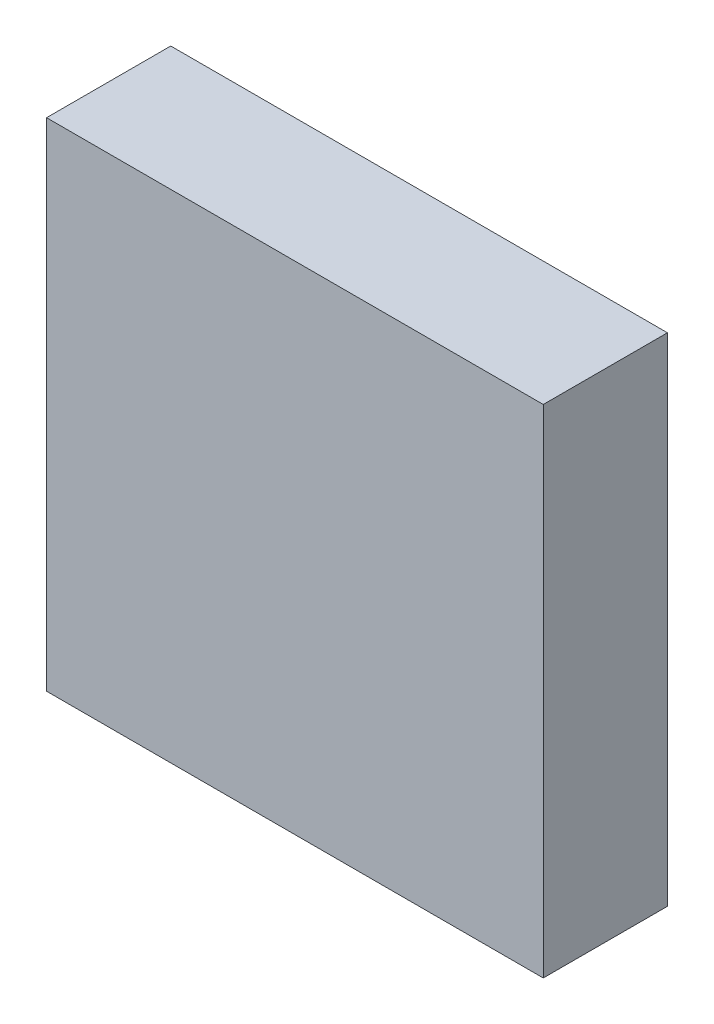
ISO-10303-21;
HEADER;
FILE_DESCRIPTION(('STEP AP214'),'2;1');
FILE_NAME('part.step','',(''),(''),'','','');
FILE_SCHEMA(('AUTOMOTIVE_DESIGN { 1 0 10303 214 1 1 1 1 }'));
ENDSEC;
DATA;
#1=APPLICATION_CONTEXT('core data for automotive mechanical design processes');
#2=APPLICATION_PROTOCOL_DEFINITION('international standard','automotive_design',2000,#1);
#3=PRODUCT_CONTEXT('',#1,'mechanical');
#4=PRODUCT('Part','Part','',(#3));
#5=PRODUCT_RELATED_PRODUCT_CATEGORY('part','',(#4));
#6=PRODUCT_DEFINITION_FORMATION('','',#4);
#7=PRODUCT_DEFINITION_CONTEXT('part definition',#1,'design');
#8=PRODUCT_DEFINITION('design','',#6,#7);
#9=PRODUCT_DEFINITION_SHAPE('','',#8);
#10=(LENGTH_UNIT() NAMED_UNIT(*) SI_UNIT(.MILLI.,.METRE.));
#11=(NAMED_UNIT(*) PLANE_ANGLE_UNIT() SI_UNIT($,.RADIAN.));
#12=(NAMED_UNIT(*) SI_UNIT($,.STERADIAN.) SOLID_ANGLE_UNIT());
#13=UNCERTAINTY_MEASURE_WITH_UNIT(LENGTH_MEASURE(1.E-05),#10,'distance_accuracy_value','');
#14=(GEOMETRIC_REPRESENTATION_CONTEXT(3) GLOBAL_UNCERTAINTY_ASSIGNED_CONTEXT((#13)) GLOBAL_UNIT_ASSIGNED_CONTEXT((#10,
#11,#12)) REPRESENTATION_CONTEXT('',''));
#15=CARTESIAN_POINT('',(0.,0.,0.));
#16=DIRECTION('',(0.,0.,1.));
#17=DIRECTION('',(1.,0.,0.));
#18=AXIS2_PLACEMENT_3D('',#15,#16,#17);
#19=CARTESIAN_POINT('',(-0.4,0.4,0.2));
#20=DIRECTION('',(0.,0.,1.));
#21=DIRECTION('',(1.,0.,0.));
#22=AXIS2_PLACEMENT_3D('',#19,#20,#21);
#23=PLANE('',#22);
#24=DIRECTION('',(0.,-1.,0.));
#25=VECTOR('',#24,1.);
#26=CARTESIAN_POINT('',(0.4,0.4,0.2));
#27=LINE('',#26,#25);
#28=CARTESIAN_POINT('',(0.4,0.4,0.2));
#29=VERTEX_POINT('',#28);
#30=CARTESIAN_POINT('',(0.4,-0.4,0.2));
#31=VERTEX_POINT('',#30);
#32=EDGE_CURVE('E59',#29,#31,#27,.T.);
#33=ORIENTED_EDGE('',*,*,#32,.F.);
#34=DIRECTION('',(1.,0.,0.));
#35=VECTOR('',#34,1.);
#36=CARTESIAN_POINT('',(-0.4,0.4,0.2));
#37=LINE('',#36,#35);
#38=CARTESIAN_POINT('',(-0.4,0.4,0.2));
#39=VERTEX_POINT('',#38);
#40=EDGE_CURVE('E61',#39,#29,#37,.T.);
#41=ORIENTED_EDGE('',*,*,#40,.F.);
#42=DIRECTION('',(0.,1.,0.));
#43=VECTOR('',#42,1.);
#44=CARTESIAN_POINT('',(-0.4,-0.4,0.2));
#45=LINE('',#44,#43);
#46=CARTESIAN_POINT('',(-0.4,-0.4,0.2));
#47=VERTEX_POINT('',#46);
#48=EDGE_CURVE('E11',#47,#39,#45,.T.);
#49=ORIENTED_EDGE('',*,*,#48,.F.);
#50=DIRECTION('',(-1.,0.,0.));
#51=VECTOR('',#50,1.);
#52=CARTESIAN_POINT('',(0.4,-0.4,0.2));
#53=LINE('',#52,#51);
#54=EDGE_CURVE('E25',#31,#47,#53,.T.);
#55=ORIENTED_EDGE('',*,*,#54,.F.);
#56=EDGE_LOOP('',(#33,#41,#49,#55));
#57=FACE_BOUND('',#56,.T.);
#58=ADVANCED_FACE('F17',(#57),#23,.T.);
#59=CARTESIAN_POINT('',(-0.4,-0.4,0.));
#60=DIRECTION('',(-1.,0.,0.));
#61=DIRECTION('',(0.,0.,1.));
#62=AXIS2_PLACEMENT_3D('',#59,#60,#61);
#63=PLANE('',#62);
#64=DIRECTION('',(0.,0.,1.));
#65=VECTOR('',#64,1.);
#66=CARTESIAN_POINT('',(-0.4,0.4,0.));
#67=LINE('',#66,#65);
#68=CARTESIAN_POINT('',(-0.4,0.4,0.));
#69=VERTEX_POINT('',#68);
#70=EDGE_CURVE('E77',#69,#39,#67,.T.);
#71=ORIENTED_EDGE('',*,*,#70,.F.);
#72=DIRECTION('',(0.,-1.,0.));
#73=VECTOR('',#72,1.);
#74=CARTESIAN_POINT('',(-0.4,0.4,0.));
#75=LINE('',#74,#73);
#76=CARTESIAN_POINT('',(-0.4,-0.4,0.));
#77=VERTEX_POINT('',#76);
#78=EDGE_CURVE('E93',#69,#77,#75,.T.);
#79=ORIENTED_EDGE('',*,*,#78,.T.);
#80=DIRECTION('',(0.,0.,-1.));
#81=VECTOR('',#80,1.);
#82=CARTESIAN_POINT('',(-0.4,-0.4,0.));
#83=LINE('',#82,#81);
#84=EDGE_CURVE('E68',#47,#77,#83,.T.);
#85=ORIENTED_EDGE('',*,*,#84,.F.);
#86=ORIENTED_EDGE('',*,*,#48,.T.);
#87=EDGE_LOOP('',(#71,#79,#85,#86));
#88=FACE_BOUND('',#87,.T.);
#89=ADVANCED_FACE('F113',(#88),#63,.T.);
#90=CARTESIAN_POINT('',(0.4,-0.4,0.));
#91=DIRECTION('',(0.,-1.,0.));
#92=DIRECTION('',(0.,0.,-1.));
#93=AXIS2_PLACEMENT_3D('',#90,#91,#92);
#94=PLANE('',#93);
#95=ORIENTED_EDGE('',*,*,#84,.T.);
#96=DIRECTION('',(1.,0.,0.));
#97=VECTOR('',#96,1.);
#98=CARTESIAN_POINT('',(-0.4,-0.4,0.));
#99=LINE('',#98,#97);
#100=CARTESIAN_POINT('',(0.4,-0.4,0.));
#101=VERTEX_POINT('',#100);
#102=EDGE_CURVE('E110',#77,#101,#99,.T.);
#103=ORIENTED_EDGE('',*,*,#102,.T.);
#104=DIRECTION('',(0.,0.,-1.));
#105=VECTOR('',#104,1.);
#106=CARTESIAN_POINT('',(0.4,-0.4,0.));
#107=LINE('',#106,#105);
#108=EDGE_CURVE('E69',#31,#101,#107,.T.);
#109=ORIENTED_EDGE('',*,*,#108,.F.);
#110=ORIENTED_EDGE('',*,*,#54,.T.);
#111=EDGE_LOOP('',(#95,#103,#109,#110));
#112=FACE_BOUND('',#111,.T.);
#113=ADVANCED_FACE('F107',(#112),#94,.T.);
#114=CARTESIAN_POINT('',(0.4,0.4,0.));
#115=DIRECTION('',(1.,0.,0.));
#116=DIRECTION('',(0.,1.,0.));
#117=AXIS2_PLACEMENT_3D('',#114,#115,#116);
#118=PLANE('',#117);
#119=ORIENTED_EDGE('',*,*,#108,.T.);
#120=DIRECTION('',(0.,1.,0.));
#121=VECTOR('',#120,1.);
#122=CARTESIAN_POINT('',(0.4,0.4,0.));
#123=LINE('',#122,#121);
#124=CARTESIAN_POINT('',(0.4,0.4,0.));
#125=VERTEX_POINT('',#124);
#126=EDGE_CURVE('E83',#101,#125,#123,.T.);
#127=ORIENTED_EDGE('',*,*,#126,.T.);
#128=DIRECTION('',(0.,0.,-1.));
#129=VECTOR('',#128,1.);
#130=CARTESIAN_POINT('',(0.4,0.4,0.));
#131=LINE('',#130,#129);
#132=EDGE_CURVE('E75',#29,#125,#131,.T.);
#133=ORIENTED_EDGE('',*,*,#132,.F.);
#134=ORIENTED_EDGE('',*,*,#32,.T.);
#135=EDGE_LOOP('',(#119,#127,#133,#134));
#136=FACE_BOUND('',#135,.T.);
#137=ADVANCED_FACE('F81',(#136),#118,.T.);
#138=CARTESIAN_POINT('',(-0.4,0.4,0.));
#139=DIRECTION('',(0.,1.,0.));
#140=DIRECTION('',(1.,0.,0.));
#141=AXIS2_PLACEMENT_3D('',#138,#139,#140);
#142=PLANE('',#141);
#143=ORIENTED_EDGE('',*,*,#132,.T.);
#144=DIRECTION('',(-1.,0.,0.));
#145=VECTOR('',#144,1.);
#146=CARTESIAN_POINT('',(-0.4,0.4,0.));
#147=LINE('',#146,#145);
#148=EDGE_CURVE('E85',#125,#69,#147,.T.);
#149=ORIENTED_EDGE('',*,*,#148,.T.);
#150=ORIENTED_EDGE('',*,*,#70,.T.);
#151=ORIENTED_EDGE('',*,*,#40,.T.);
#152=EDGE_LOOP('',(#143,#149,#150,#151));
#153=FACE_BOUND('',#152,.T.);
#154=ADVANCED_FACE('F73',(#153),#142,.T.);
#155=CARTESIAN_POINT('',(-0.4,0.4,0.));
#156=DIRECTION('',(0.,0.,1.));
#157=DIRECTION('',(1.,0.,0.));
#158=AXIS2_PLACEMENT_3D('',#155,#156,#157);
#159=PLANE('',#158);
#160=ORIENTED_EDGE('',*,*,#126,.F.);
#161=ORIENTED_EDGE('',*,*,#102,.F.);
#162=ORIENTED_EDGE('',*,*,#78,.F.);
#163=ORIENTED_EDGE('',*,*,#148,.F.);
#164=EDGE_LOOP('',(#160,#161,#162,#163));
#165=FACE_BOUND('',#164,.T.);
#166=ADVANCED_FACE('F116',(#165),#159,.F.);
#167=CLOSED_SHELL('',(#58,#89,#113,#137,#154,#166));
#168=MANIFOLD_SOLID_BREP('B1',#167);
#169=ADVANCED_BREP_SHAPE_REPRESENTATION('',(#18,#168),#14);
#170=SHAPE_DEFINITION_REPRESENTATION(#9,#169);
ENDSEC;
END-ISO-10303-21;
